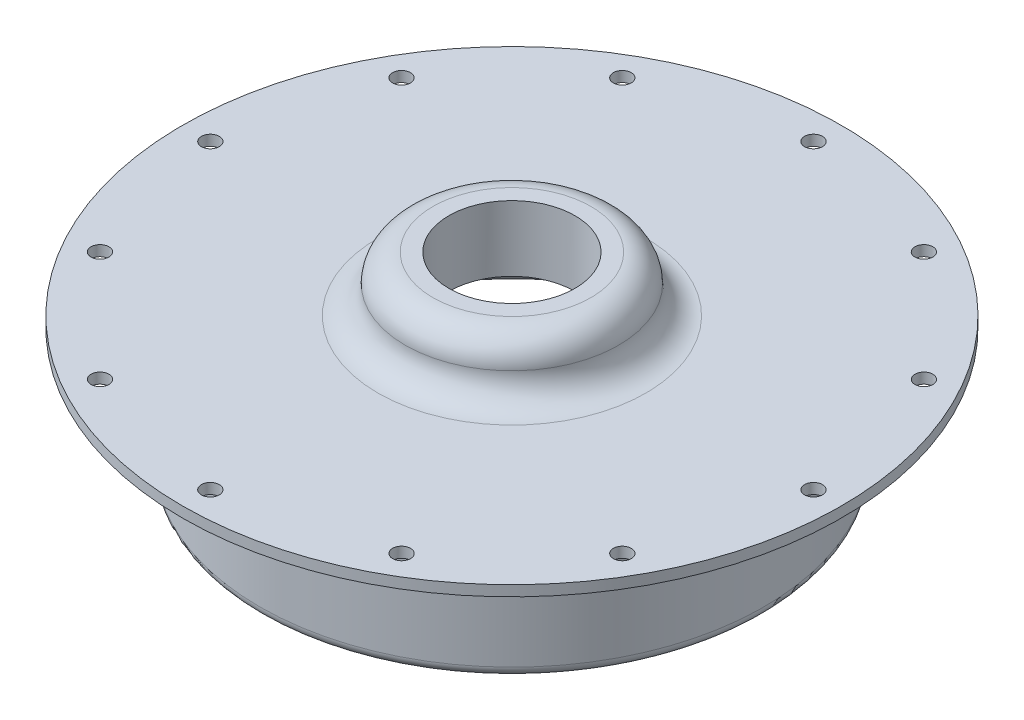
ISO-10303-21;
HEADER;
FILE_DESCRIPTION(('STEP AP214'),'2;1');
FILE_NAME('part.step','',(''),(''),'','','');
FILE_SCHEMA(('AUTOMOTIVE_DESIGN { 1 0 10303 214 1 1 1 1 }'));
ENDSEC;
DATA;
#1=APPLICATION_CONTEXT('core data for automotive mechanical design processes');
#2=APPLICATION_PROTOCOL_DEFINITION('international standard','automotive_design',2000,#1);
#3=PRODUCT_CONTEXT('',#1,'mechanical');
#4=PRODUCT('Part','Part','',(#3));
#5=PRODUCT_RELATED_PRODUCT_CATEGORY('part','',(#4));
#6=PRODUCT_DEFINITION_FORMATION('','',#4);
#7=PRODUCT_DEFINITION_CONTEXT('part definition',#1,'design');
#8=PRODUCT_DEFINITION('design','',#6,#7);
#9=PRODUCT_DEFINITION_SHAPE('','',#8);
#10=(LENGTH_UNIT() NAMED_UNIT(*) SI_UNIT(.MILLI.,.METRE.));
#11=(NAMED_UNIT(*) PLANE_ANGLE_UNIT() SI_UNIT($,.RADIAN.));
#12=(NAMED_UNIT(*) SI_UNIT($,.STERADIAN.) SOLID_ANGLE_UNIT());
#13=UNCERTAINTY_MEASURE_WITH_UNIT(LENGTH_MEASURE(1.E-05),#10,'distance_accuracy_value','');
#14=(GEOMETRIC_REPRESENTATION_CONTEXT(3) GLOBAL_UNCERTAINTY_ASSIGNED_CONTEXT((#13)) GLOBAL_UNIT_ASSIGNED_CONTEXT((#10,
#11,#12)) REPRESENTATION_CONTEXT('',''));
#15=CARTESIAN_POINT('',(0.,0.,0.));
#16=DIRECTION('',(0.,0.,1.));
#17=DIRECTION('',(1.,0.,0.));
#18=AXIS2_PLACEMENT_3D('',#15,#16,#17);
#19=CARTESIAN_POINT('',(0.,55.,0.));
#20=DIRECTION('',(0.,1.,0.));
#21=DIRECTION('',(0.,0.,1.));
#22=AXIS2_PLACEMENT_3D('',#19,#20,#21);
#23=CYLINDRICAL_SURFACE('',#22,49.784);
#24=CARTESIAN_POINT('',(0.,0.,0.));
#25=DIRECTION('',(0.,1.,0.));
#26=DIRECTION('',(0.,0.,1.));
#27=AXIS2_PLACEMENT_3D('',#24,#25,#26);
#28=CIRCLE('',#27,49.784);
#29=CARTESIAN_POINT('',(0.,0.,49.784));
#30=VERTEX_POINT('',#29);
#31=EDGE_CURVE('E10',#30,#30,#28,.T.);
#32=ORIENTED_EDGE('',*,*,#31,.T.);
#33=EDGE_LOOP('',(#32));
#34=FACE_BOUND('',#33,.T.);
#35=CARTESIAN_POINT('',(0.,1.5875,0.));
#36=DIRECTION('',(0.,1.,0.));
#37=DIRECTION('',(0.,0.,1.));
#38=AXIS2_PLACEMENT_3D('',#35,#36,#37);
#39=CIRCLE('',#38,49.784);
#40=CARTESIAN_POINT('',(0.,1.5875,49.784));
#41=VERTEX_POINT('',#40);
#42=EDGE_CURVE('E68',#41,#41,#39,.T.);
#43=ORIENTED_EDGE('',*,*,#42,.F.);
#44=EDGE_LOOP('',(#43));
#45=FACE_BOUND('',#44,.T.);
#46=ADVANCED_FACE('F31',(#34,#45),#23,.T.);
#47=CARTESIAN_POINT('',(-49.784,0.,0.));
#48=DIRECTION('',(0.,-1.,0.));
#49=DIRECTION('',(0.,0.,-1.));
#50=AXIS2_PLACEMENT_3D('',#47,#48,#49);
#51=PLANE('',#50);
#52=CARTESIAN_POINT('',(-39.4517006668589,0.,-22.7774500000015));
#53=DIRECTION('',(0.,-1.,0.));
#54=DIRECTION('',(0.,0.,-1.));
#55=AXIS2_PLACEMENT_3D('',#52,#53,#54);
#56=CIRCLE('',#55,1.35254999999999);
#57=CARTESIAN_POINT('',(-39.4517006668589,0.,-24.1300000000015));
#58=VERTEX_POINT('',#57);
#59=EDGE_CURVE('E134',#58,#58,#56,.T.);
#60=ORIENTED_EDGE('',*,*,#59,.F.);
#61=EDGE_LOOP('',(#60));
#62=FACE_BOUND('',#61,.T.);
#63=CARTESIAN_POINT('',(-22.7774499999985,0.,-39.4517006668606));
#64=DIRECTION('',(0.,-1.,0.));
#65=DIRECTION('',(0.,0.,-1.));
#66=AXIS2_PLACEMENT_3D('',#63,#64,#65);
#67=CIRCLE('',#66,1.35254999999999);
#68=CARTESIAN_POINT('',(-22.7774499999985,0.,-40.8042506668606));
#69=VERTEX_POINT('',#68);
#70=EDGE_CURVE('E128',#69,#69,#67,.T.);
#71=ORIENTED_EDGE('',*,*,#70,.F.);
#72=EDGE_LOOP('',(#71));
#73=FACE_BOUND('',#72,.T.);
#74=CARTESIAN_POINT('',(1.78252687187594E-12,0.,-45.5549));
#75=DIRECTION('',(0.,-1.,0.));
#76=DIRECTION('',(0.,0.,-1.));
#77=AXIS2_PLACEMENT_3D('',#74,#75,#76);
#78=CIRCLE('',#77,1.35254999999999);
#79=CARTESIAN_POINT('',(1.78252687187594E-12,0.,-46.90745));
#80=VERTEX_POINT('',#79);
#81=EDGE_CURVE('E122',#80,#80,#78,.T.);
#82=ORIENTED_EDGE('',*,*,#81,.F.);
#83=EDGE_LOOP('',(#82));
#84=FACE_BOUND('',#83,.T.);
#85=CARTESIAN_POINT('',(22.7774500000016,0.,-39.4517006668588));
#86=DIRECTION('',(0.,-1.,0.));
#87=DIRECTION('',(0.,0.,-1.));
#88=AXIS2_PLACEMENT_3D('',#85,#86,#87);
#89=CIRCLE('',#88,1.35254999999999);
#90=CARTESIAN_POINT('',(22.7774500000016,0.,-40.8042506668588));
#91=VERTEX_POINT('',#90);
#92=EDGE_CURVE('E116',#91,#91,#89,.T.);
#93=ORIENTED_EDGE('',*,*,#92,.F.);
#94=EDGE_LOOP('',(#93));
#95=FACE_BOUND('',#94,.T.);
#96=CARTESIAN_POINT('',(39.4517006668607,0.,-22.7774499999984));
#97=DIRECTION('',(0.,-1.,0.));
#98=DIRECTION('',(0.,0.,-1.));
#99=AXIS2_PLACEMENT_3D('',#96,#97,#98);
#100=CIRCLE('',#99,1.35254999999999);
#101=CARTESIAN_POINT('',(39.4517006668607,0.,-24.1299999999984));
#102=VERTEX_POINT('',#101);
#103=EDGE_CURVE('E34',#102,#102,#100,.T.);
#104=ORIENTED_EDGE('',*,*,#103,.F.);
#105=EDGE_LOOP('',(#104));
#106=FACE_BOUND('',#105,.T.);
#107=CARTESIAN_POINT('',(45.5549,0.,2.26523184822995E-12));
#108=DIRECTION('',(0.,-1.,0.));
#109=DIRECTION('',(0.,0.,-1.));
#110=AXIS2_PLACEMENT_3D('',#107,#108,#109);
#111=CIRCLE('',#110,1.35254999999999);
#112=CARTESIAN_POINT('',(45.5549,0.,-1.35254999999773));
#113=VERTEX_POINT('',#112);
#114=EDGE_CURVE('E107',#113,#113,#111,.T.);
#115=ORIENTED_EDGE('',*,*,#114,.F.);
#116=EDGE_LOOP('',(#115));
#117=FACE_BOUND('',#116,.T.);
#118=CARTESIAN_POINT('',(39.4517006668587,0.,22.7774500000017));
#119=DIRECTION('',(0.,-1.,0.));
#120=DIRECTION('',(0.,0.,-1.));
#121=AXIS2_PLACEMENT_3D('',#118,#119,#120);
#122=CIRCLE('',#121,1.35254999999999);
#123=CARTESIAN_POINT('',(39.4517006668587,0.,21.4249000000017));
#124=VERTEX_POINT('',#123);
#125=EDGE_CURVE('E101',#124,#124,#122,.T.);
#126=ORIENTED_EDGE('',*,*,#125,.F.);
#127=EDGE_LOOP('',(#126));
#128=FACE_BOUND('',#127,.T.);
#129=CARTESIAN_POINT('',(22.7774499999982,0.,39.4517006668608));
#130=DIRECTION('',(0.,-1.,0.));
#131=DIRECTION('',(0.,0.,-1.));
#132=AXIS2_PLACEMENT_3D('',#129,#130,#131);
#133=CIRCLE('',#132,1.35254999999999);
#134=CARTESIAN_POINT('',(22.7774499999982,0.,38.0991506668608));
#135=VERTEX_POINT('',#134);
#136=EDGE_CURVE('E95',#135,#135,#133,.T.);
#137=ORIENTED_EDGE('',*,*,#136,.F.);
#138=EDGE_LOOP('',(#137));
#139=FACE_BOUND('',#138,.T.);
#140=CARTESIAN_POINT('',(-2.1117204916125E-12,0.,45.5549));
#141=DIRECTION('',(0.,-1.,0.));
#142=DIRECTION('',(0.,0.,-1.));
#143=AXIS2_PLACEMENT_3D('',#140,#141,#142);
#144=CIRCLE('',#143,1.35254999999999);
#145=CARTESIAN_POINT('',(-2.1117204916125E-12,0.,44.20235));
#146=VERTEX_POINT('',#145);
#147=EDGE_CURVE('E89',#146,#146,#144,.T.);
#148=ORIENTED_EDGE('',*,*,#147,.F.);
#149=EDGE_LOOP('',(#148));
#150=FACE_BOUND('',#149,.T.);
#151=CARTESIAN_POINT('',(-22.7774500000019,0.,39.4517006668587));
#152=DIRECTION('',(0.,-1.,0.));
#153=DIRECTION('',(0.,0.,-1.));
#154=AXIS2_PLACEMENT_3D('',#151,#152,#153);
#155=CIRCLE('',#154,1.35254999999999);
#156=CARTESIAN_POINT('',(-22.7774500000019,0.,38.0991506668587));
#157=VERTEX_POINT('',#156);
#158=EDGE_CURVE('E83',#157,#157,#155,.T.);
#159=ORIENTED_EDGE('',*,*,#158,.F.);
#160=EDGE_LOOP('',(#159));
#161=FACE_BOUND('',#160,.T.);
#162=CARTESIAN_POINT('',(-39.4517006668608,0.,22.7774499999981));
#163=DIRECTION('',(0.,-1.,0.));
#164=DIRECTION('',(0.,0.,-1.));
#165=AXIS2_PLACEMENT_3D('',#162,#163,#164);
#166=CIRCLE('',#165,1.35254999999999);
#167=CARTESIAN_POINT('',(-39.4517006668608,0.,21.4248999999981));
#168=VERTEX_POINT('',#167);
#169=EDGE_CURVE('E77',#168,#168,#166,.T.);
#170=ORIENTED_EDGE('',*,*,#169,.F.);
#171=EDGE_LOOP('',(#170));
#172=FACE_BOUND('',#171,.T.);
#173=CARTESIAN_POINT('',(-45.5549,0.,-2.26523184822995E-12));
#174=DIRECTION('',(0.,-1.,0.));
#175=DIRECTION('',(0.,0.,-1.));
#176=AXIS2_PLACEMENT_3D('',#173,#174,#175);
#177=CIRCLE('',#176,1.35254999999999);
#178=CARTESIAN_POINT('',(-45.5549,0.,-1.35255000000226));
#179=VERTEX_POINT('',#178);
#180=EDGE_CURVE('E71',#179,#179,#177,.T.);
#181=ORIENTED_EDGE('',*,*,#180,.F.);
#182=EDGE_LOOP('',(#181));
#183=FACE_BOUND('',#182,.T.);
#184=CARTESIAN_POINT('',(0.,0.,0.));
#185=DIRECTION('',(0.,1.,0.));
#186=DIRECTION('',(0.,0.,1.));
#187=AXIS2_PLACEMENT_3D('',#184,#185,#186);
#188=CIRCLE('',#187,39.6874999999754);
#189=CARTESIAN_POINT('',(0.,0.,39.6874999999754));
#190=VERTEX_POINT('',#189);
#191=EDGE_CURVE('E38',#190,#190,#188,.T.);
#192=ORIENTED_EDGE('',*,*,#191,.T.);
#193=EDGE_LOOP('',(#192));
#194=FACE_BOUND('',#193,.T.);
#195=ORIENTED_EDGE('',*,*,#31,.F.);
#196=EDGE_LOOP('',(#195));
#197=FACE_BOUND('',#196,.T.);
#198=ADVANCED_FACE('F168',(#62,#73,#84,#95,#106,#117,#128,#139,#150,#161,#172,#183,#194,#197),
#51,.T.);
#199=CARTESIAN_POINT('',(0.,-1.5875,0.));
#200=DIRECTION('',(0.,1.,0.));
#201=DIRECTION('',(0.,0.,1.));
#202=AXIS2_PLACEMENT_3D('',#199,#200,#201);
#203=TOROIDAL_SURFACE('',#202,39.6874999999754,1.5875);
#204=CARTESIAN_POINT('',(0.,-1.5875,0.));
#205=DIRECTION('',(0.,1.,0.));
#206=DIRECTION('',(0.,0.,1.));
#207=AXIS2_PLACEMENT_3D('',#204,#205,#206);
#208=CIRCLE('',#207,38.0999999999754);
#209=CARTESIAN_POINT('',(0.,-1.5875,38.0999999999754));
#210=VERTEX_POINT('',#209);
#211=EDGE_CURVE('E42',#210,#210,#208,.T.);
#212=ORIENTED_EDGE('',*,*,#211,.T.);
#213=EDGE_LOOP('',(#212));
#214=FACE_BOUND('',#213,.T.);
#215=ORIENTED_EDGE('',*,*,#191,.F.);
#216=EDGE_LOOP('',(#215));
#217=FACE_BOUND('',#216,.T.);
#218=ADVANCED_FACE('F172',(#214,#217),#203,.F.);
#219=CARTESIAN_POINT('',(0.,55.,0.));
#220=DIRECTION('',(0.,1.,0.));
#221=DIRECTION('',(0.,0.,1.));
#222=AXIS2_PLACEMENT_3D('',#219,#220,#221);
#223=CYLINDRICAL_SURFACE('',#222,38.0999999999754);
#224=CARTESIAN_POINT('',(0.,-17.4625,0.));
#225=DIRECTION('',(0.,1.,0.));
#226=DIRECTION('',(0.,0.,1.));
#227=AXIS2_PLACEMENT_3D('',#224,#225,#226);
#228=CIRCLE('',#227,38.0999999999754);
#229=CARTESIAN_POINT('',(0.,-17.4625,38.0999999999754));
#230=VERTEX_POINT('',#229);
#231=EDGE_CURVE('E47',#230,#230,#228,.T.);
#232=ORIENTED_EDGE('',*,*,#231,.T.);
#233=EDGE_LOOP('',(#232));
#234=FACE_BOUND('',#233,.T.);
#235=ORIENTED_EDGE('',*,*,#211,.F.);
#236=EDGE_LOOP('',(#235));
#237=FACE_BOUND('',#236,.T.);
#238=ADVANCED_FACE('F263',(#234,#237),#223,.T.);
#239=CARTESIAN_POINT('',(0.,-17.4625,0.));
#240=DIRECTION('',(0.,1.,0.));
#241=DIRECTION('',(0.,0.,1.));
#242=AXIS2_PLACEMENT_3D('',#239,#240,#241);
#243=TOROIDAL_SURFACE('',#242,36.5124999999754,1.5875);
#244=CARTESIAN_POINT('',(0.,-17.4625,0.));
#245=DIRECTION('',(0.,1.,0.));
#246=DIRECTION('',(0.,0.,1.));
#247=AXIS2_PLACEMENT_3D('',#244,#245,#246);
#248=CIRCLE('',#247,34.9249999999754);
#249=CARTESIAN_POINT('',(0.,-17.4625,34.9249999999754));
#250=VERTEX_POINT('',#249);
#251=EDGE_CURVE('E50',#250,#250,#248,.T.);
#252=ORIENTED_EDGE('',*,*,#251,.T.);
#253=EDGE_LOOP('',(#252));
#254=FACE_BOUND('',#253,.T.);
#255=ORIENTED_EDGE('',*,*,#231,.F.);
#256=EDGE_LOOP('',(#255));
#257=FACE_BOUND('',#256,.T.);
#258=ADVANCED_FACE('F257',(#254,#257),#243,.T.);
#259=CARTESIAN_POINT('',(0.,55.,0.));
#260=DIRECTION('',(0.,1.,0.));
#261=DIRECTION('',(0.,0.,1.));
#262=AXIS2_PLACEMENT_3D('',#259,#260,#261);
#263=CYLINDRICAL_SURFACE('',#262,34.9249999999754);
#264=CARTESIAN_POINT('',(0.,-3.175,0.));
#265=DIRECTION('',(0.,1.,0.));
#266=DIRECTION('',(0.,0.,1.));
#267=AXIS2_PLACEMENT_3D('',#264,#265,#266);
#268=CIRCLE('',#267,34.9249999999754);
#269=CARTESIAN_POINT('',(0.,-3.175,34.9249999999754));
#270=VERTEX_POINT('',#269);
#271=EDGE_CURVE('E53',#270,#270,#268,.T.);
#272=ORIENTED_EDGE('',*,*,#271,.T.);
#273=EDGE_LOOP('',(#272));
#274=FACE_BOUND('',#273,.T.);
#275=ORIENTED_EDGE('',*,*,#251,.F.);
#276=EDGE_LOOP('',(#275));
#277=FACE_BOUND('',#276,.T.);
#278=ADVANCED_FACE('F251',(#274,#277),#263,.F.);
#279=CARTESIAN_POINT('',(0.,-3.175,0.));
#280=DIRECTION('',(0.,1.,0.));
#281=DIRECTION('',(0.,0.,1.));
#282=AXIS2_PLACEMENT_3D('',#279,#280,#281);
#283=TOROIDAL_SURFACE('',#282,31.7499999999754,3.17499999999999);
#284=CARTESIAN_POINT('',(0.,0.,0.));
#285=DIRECTION('',(0.,1.,0.));
#286=DIRECTION('',(0.,0.,1.));
#287=AXIS2_PLACEMENT_3D('',#284,#285,#286);
#288=CIRCLE('',#287,31.7499999999754);
#289=CARTESIAN_POINT('',(0.,0.,31.7499999999754));
#290=VERTEX_POINT('',#289);
#291=EDGE_CURVE('E56',#290,#290,#288,.T.);
#292=ORIENTED_EDGE('',*,*,#291,.T.);
#293=EDGE_LOOP('',(#292));
#294=FACE_BOUND('',#293,.T.);
#295=ORIENTED_EDGE('',*,*,#271,.F.);
#296=EDGE_LOOP('',(#295));
#297=FACE_BOUND('',#296,.T.);
#298=ADVANCED_FACE('F245',(#294,#297),#283,.F.);
#299=CARTESIAN_POINT('',(-31.7499999999754,0.,0.));
#300=DIRECTION('',(0.,-1.,0.));
#301=DIRECTION('',(0.,0.,-1.));
#302=AXIS2_PLACEMENT_3D('',#299,#300,#301);
#303=PLANE('',#302);
#304=CARTESIAN_POINT('',(0.,0.,0.));
#305=DIRECTION('',(0.,-1.,0.));
#306=DIRECTION('',(0.,0.,-1.));
#307=AXIS2_PLACEMENT_3D('',#304,#305,#306);
#308=CIRCLE('',#307,9.52499999999998);
#309=CARTESIAN_POINT('',(0.,0.,-9.52499999999998));
#310=VERTEX_POINT('',#309);
#311=EDGE_CURVE('E140',#310,#310,#308,.T.);
#312=ORIENTED_EDGE('',*,*,#311,.F.);
#313=EDGE_LOOP('',(#312));
#314=FACE_BOUND('',#313,.T.);
#315=ORIENTED_EDGE('',*,*,#291,.F.);
#316=EDGE_LOOP('',(#315));
#317=FACE_BOUND('',#316,.T.);
#318=ADVANCED_FACE('F153',(#314,#317),#303,.T.);
#319=CARTESIAN_POINT('',(-5.588,9.906,0.));
#320=DIRECTION('',(0.,1.,0.));
#321=DIRECTION('',(0.,0.,1.));
#322=AXIS2_PLACEMENT_3D('',#319,#320,#321);
#323=PLANE('',#322);
#324=CARTESIAN_POINT('',(0.,9.906,0.));
#325=DIRECTION('',(0.,1.,0.));
#326=DIRECTION('',(0.,0.,1.));
#327=AXIS2_PLACEMENT_3D('',#324,#325,#326);
#328=CIRCLE('',#327,9.52499999999999);
#329=CARTESIAN_POINT('',(0.,9.906,9.52499999999999));
#330=VERTEX_POINT('',#329);
#331=EDGE_CURVE('E143',#330,#330,#328,.T.);
#332=ORIENTED_EDGE('',*,*,#331,.F.);
#333=EDGE_LOOP('',(#332));
#334=FACE_BOUND('',#333,.T.);
#335=CARTESIAN_POINT('',(0.,9.906,0.));
#336=DIRECTION('',(0.,1.,0.));
#337=DIRECTION('',(0.,0.,1.));
#338=AXIS2_PLACEMENT_3D('',#335,#336,#337);
#339=CIRCLE('',#338,11.938);
#340=CARTESIAN_POINT('',(0.,9.906,11.938));
#341=VERTEX_POINT('',#340);
#342=EDGE_CURVE('E59',#341,#341,#339,.T.);
#343=ORIENTED_EDGE('',*,*,#342,.T.);
#344=EDGE_LOOP('',(#343));
#345=FACE_BOUND('',#344,.T.);
#346=ADVANCED_FACE('F149',(#334,#345),#323,.T.);
#347=CARTESIAN_POINT('',(0.,5.74675,0.));
#348=DIRECTION('',(0.,1.,0.));
#349=DIRECTION('',(0.,0.,1.));
#350=AXIS2_PLACEMENT_3D('',#347,#348,#349);
#351=TOROIDAL_SURFACE('',#350,11.938,4.15925);
#352=CARTESIAN_POINT('',(0.,5.74675,0.));
#353=DIRECTION('',(0.,1.,0.));
#354=DIRECTION('',(0.,0.,1.));
#355=AXIS2_PLACEMENT_3D('',#352,#353,#354);
#356=CIRCLE('',#355,16.09725);
#357=CARTESIAN_POINT('',(0.,5.74675,16.09725));
#358=VERTEX_POINT('',#357);
#359=EDGE_CURVE('E62',#358,#358,#356,.T.);
#360=ORIENTED_EDGE('',*,*,#359,.T.);
#361=EDGE_LOOP('',(#360));
#362=FACE_BOUND('',#361,.T.);
#363=ORIENTED_EDGE('',*,*,#342,.F.);
#364=EDGE_LOOP('',(#363));
#365=FACE_BOUND('',#364,.T.);
#366=ADVANCED_FACE('F152',(#362,#365),#351,.T.);
#367=CARTESIAN_POINT('',(0.,5.74675,0.));
#368=DIRECTION('',(0.,1.,0.));
#369=DIRECTION('',(0.,0.,1.));
#370=AXIS2_PLACEMENT_3D('',#367,#368,#369);
#371=TOROIDAL_SURFACE('',#370,20.2565,4.15925);
#372=CARTESIAN_POINT('',(0.,1.5875,0.));
#373=DIRECTION('',(0.,1.,0.));
#374=DIRECTION('',(0.,0.,1.));
#375=AXIS2_PLACEMENT_3D('',#372,#373,#374);
#376=CIRCLE('',#375,20.2565);
#377=CARTESIAN_POINT('',(0.,1.5875,20.2565));
#378=VERTEX_POINT('',#377);
#379=EDGE_CURVE('E65',#378,#378,#376,.T.);
#380=ORIENTED_EDGE('',*,*,#379,.T.);
#381=EDGE_LOOP('',(#380));
#382=FACE_BOUND('',#381,.T.);
#383=ORIENTED_EDGE('',*,*,#359,.F.);
#384=EDGE_LOOP('',(#383));
#385=FACE_BOUND('',#384,.T.);
#386=ADVANCED_FACE('F158',(#382,#385),#371,.F.);
#387=CARTESIAN_POINT('',(-49.784,1.5875,0.));
#388=DIRECTION('',(0.,1.,0.));
#389=DIRECTION('',(0.,0.,1.));
#390=AXIS2_PLACEMENT_3D('',#387,#388,#389);
#391=PLANE('',#390);
#392=CARTESIAN_POINT('',(-39.4517006668589,1.58750000000002,-22.7774500000015));
#393=DIRECTION('',(0.,1.,0.));
#394=DIRECTION('',(0.,0.,1.));
#395=AXIS2_PLACEMENT_3D('',#392,#393,#394);
#396=CIRCLE('',#395,1.35254999999999);
#397=CARTESIAN_POINT('',(-39.4517006668589,1.58750000000002,-21.4249000000015));
#398=VERTEX_POINT('',#397);
#399=EDGE_CURVE('E137',#398,#398,#396,.T.);
#400=ORIENTED_EDGE('',*,*,#399,.F.);
#401=EDGE_LOOP('',(#400));
#402=FACE_BOUND('',#401,.T.);
#403=CARTESIAN_POINT('',(-22.7774499999985,1.58750000000008,-39.4517006668606));
#404=DIRECTION('',(0.,1.,0.));
#405=DIRECTION('',(0.,0.,1.));
#406=AXIS2_PLACEMENT_3D('',#403,#404,#405);
#407=CIRCLE('',#406,1.35254999999999);
#408=CARTESIAN_POINT('',(-22.7774499999985,1.58750000000008,-38.0991506668606));
#409=VERTEX_POINT('',#408);
#410=EDGE_CURVE('E131',#409,#409,#407,.T.);
#411=ORIENTED_EDGE('',*,*,#410,.F.);
#412=EDGE_LOOP('',(#411));
#413=FACE_BOUND('',#412,.T.);
#414=CARTESIAN_POINT('',(1.78252687187594E-12,1.58750000000016,-45.5549));
#415=DIRECTION('',(0.,1.,0.));
#416=DIRECTION('',(0.,0.,1.));
#417=AXIS2_PLACEMENT_3D('',#414,#415,#416);
#418=CIRCLE('',#417,1.35254999999999);
#419=CARTESIAN_POINT('',(1.78252687187594E-12,1.58750000000015,-44.20235));
#420=VERTEX_POINT('',#419);
#421=EDGE_CURVE('E125',#420,#420,#418,.T.);
#422=ORIENTED_EDGE('',*,*,#421,.F.);
#423=EDGE_LOOP('',(#422));
#424=FACE_BOUND('',#423,.T.);
#425=CARTESIAN_POINT('',(22.7774500000016,1.58750000000024,-39.4517006668588));
#426=DIRECTION('',(0.,1.,0.));
#427=DIRECTION('',(0.,0.,1.));
#428=AXIS2_PLACEMENT_3D('',#425,#426,#427);
#429=CIRCLE('',#428,1.35254999999999);
#430=CARTESIAN_POINT('',(22.7774500000016,1.58750000000024,-38.0991506668588));
#431=VERTEX_POINT('',#430);
#432=EDGE_CURVE('E119',#431,#431,#429,.T.);
#433=ORIENTED_EDGE('',*,*,#432,.F.);
#434=EDGE_LOOP('',(#433));
#435=FACE_BOUND('',#434,.T.);
#436=CARTESIAN_POINT('',(39.4517006668607,1.5875000000003,-22.7774499999984));
#437=DIRECTION('',(0.,1.,0.));
#438=DIRECTION('',(0.,0.,1.));
#439=AXIS2_PLACEMENT_3D('',#436,#437,#438);
#440=CIRCLE('',#439,1.35254999999999);
#441=CARTESIAN_POINT('',(39.4517006668607,1.5875000000003,-21.4248999999984));
#442=VERTEX_POINT('',#441);
#443=EDGE_CURVE('E113',#442,#442,#440,.T.);
#444=ORIENTED_EDGE('',*,*,#443,.F.);
#445=EDGE_LOOP('',(#444));
#446=FACE_BOUND('',#445,.T.);
#447=CARTESIAN_POINT('',(45.5549,1.58750000000032,2.26523184822995E-12));
#448=DIRECTION('',(0.,1.,0.));
#449=DIRECTION('',(0.,0.,1.));
#450=AXIS2_PLACEMENT_3D('',#447,#448,#449);
#451=CIRCLE('',#450,1.35254999999999);
#452=CARTESIAN_POINT('',(45.5549,1.58750000000032,1.35255000000225));
#453=VERTEX_POINT('',#452);
#454=EDGE_CURVE('E110',#453,#453,#451,.T.);
#455=ORIENTED_EDGE('',*,*,#454,.F.);
#456=EDGE_LOOP('',(#455));
#457=FACE_BOUND('',#456,.T.);
#458=CARTESIAN_POINT('',(39.4517006668587,1.5875000000003,22.7774500000017));
#459=DIRECTION('',(0.,1.,0.));
#460=DIRECTION('',(0.,0.,1.));
#461=AXIS2_PLACEMENT_3D('',#458,#459,#460);
#462=CIRCLE('',#461,1.35254999999999);
#463=CARTESIAN_POINT('',(39.4517006668587,1.5875000000003,24.1300000000017));
#464=VERTEX_POINT('',#463);
#465=EDGE_CURVE('E104',#464,#464,#462,.T.);
#466=ORIENTED_EDGE('',*,*,#465,.F.);
#467=EDGE_LOOP('',(#466));
#468=FACE_BOUND('',#467,.T.);
#469=CARTESIAN_POINT('',(22.7774499999982,1.58750000000024,39.4517006668608));
#470=DIRECTION('',(0.,1.,0.));
#471=DIRECTION('',(0.,0.,1.));
#472=AXIS2_PLACEMENT_3D('',#469,#470,#471);
#473=CIRCLE('',#472,1.35254999999999);
#474=CARTESIAN_POINT('',(22.7774499999982,1.58750000000024,40.8042506668608));
#475=VERTEX_POINT('',#474);
#476=EDGE_CURVE('E98',#475,#475,#473,.T.);
#477=ORIENTED_EDGE('',*,*,#476,.F.);
#478=EDGE_LOOP('',(#477));
#479=FACE_BOUND('',#478,.T.);
#480=CARTESIAN_POINT('',(-2.1117204916125E-12,1.58750000000016,45.5549));
#481=DIRECTION('',(0.,1.,0.));
#482=DIRECTION('',(0.,0.,1.));
#483=AXIS2_PLACEMENT_3D('',#480,#481,#482);
#484=CIRCLE('',#483,1.35254999999999);
#485=CARTESIAN_POINT('',(-2.1117204916125E-12,1.58750000000016,46.90745));
#486=VERTEX_POINT('',#485);
#487=EDGE_CURVE('E92',#486,#486,#484,.T.);
#488=ORIENTED_EDGE('',*,*,#487,.F.);
#489=EDGE_LOOP('',(#488));
#490=FACE_BOUND('',#489,.T.);
#491=CARTESIAN_POINT('',(-22.7774500000019,1.58750000000008,39.4517006668586));
#492=DIRECTION('',(0.,1.,0.));
#493=DIRECTION('',(0.,0.,1.));
#494=AXIS2_PLACEMENT_3D('',#491,#492,#493);
#495=CIRCLE('',#494,1.35254999999999);
#496=CARTESIAN_POINT('',(-22.7774500000019,1.58750000000008,40.8042506668586));
#497=VERTEX_POINT('',#496);
#498=EDGE_CURVE('E86',#497,#497,#495,.T.);
#499=ORIENTED_EDGE('',*,*,#498,.F.);
#500=EDGE_LOOP('',(#499));
#501=FACE_BOUND('',#500,.T.);
#502=CARTESIAN_POINT('',(-39.4517006668608,1.58750000000002,22.7774499999981));
#503=DIRECTION('',(0.,1.,0.));
#504=DIRECTION('',(0.,0.,1.));
#505=AXIS2_PLACEMENT_3D('',#502,#503,#504);
#506=CIRCLE('',#505,1.35254999999999);
#507=CARTESIAN_POINT('',(-39.4517006668608,1.58750000000002,24.1299999999981));
#508=VERTEX_POINT('',#507);
#509=EDGE_CURVE('E80',#508,#508,#506,.T.);
#510=ORIENTED_EDGE('',*,*,#509,.F.);
#511=EDGE_LOOP('',(#510));
#512=FACE_BOUND('',#511,.T.);
#513=CARTESIAN_POINT('',(-45.5549,1.5875,-2.26523184822995E-12));
#514=DIRECTION('',(0.,1.,0.));
#515=DIRECTION('',(0.,0.,1.));
#516=AXIS2_PLACEMENT_3D('',#513,#514,#515);
#517=CIRCLE('',#516,1.35254999999999);
#518=CARTESIAN_POINT('',(-45.5549,1.5875,1.35254999999772));
#519=VERTEX_POINT('',#518);
#520=EDGE_CURVE('E74',#519,#519,#517,.T.);
#521=ORIENTED_EDGE('',*,*,#520,.F.);
#522=EDGE_LOOP('',(#521));
#523=FACE_BOUND('',#522,.T.);
#524=ORIENTED_EDGE('',*,*,#42,.T.);
#525=EDGE_LOOP('',(#524));
#526=FACE_BOUND('',#525,.T.);
#527=ORIENTED_EDGE('',*,*,#379,.F.);
#528=EDGE_LOOP('',(#527));
#529=FACE_BOUND('',#528,.T.);
#530=ADVANCED_FACE('F164',(#402,#413,#424,#435,#446,#457,#468,#479,#490,#501,#512,#523,#526,
#529),#391,.T.);
#531=CARTESIAN_POINT('',(-45.5549,1.5875,-2.26523184822995E-12));
#532=DIRECTION('',(0.,1.,0.));
#533=DIRECTION('',(0.,0.,1.));
#534=AXIS2_PLACEMENT_3D('',#531,#532,#533);
#535=CYLINDRICAL_SURFACE('',#534,1.35254999999999);
#536=ORIENTED_EDGE('',*,*,#180,.T.);
#537=EDGE_LOOP('',(#536));
#538=FACE_BOUND('',#537,.T.);
#539=ORIENTED_EDGE('',*,*,#520,.T.);
#540=EDGE_LOOP('',(#539));
#541=FACE_BOUND('',#540,.T.);
#542=ADVANCED_FACE('F179',(#538,#541),#535,.F.);
#543=CARTESIAN_POINT('',(-39.4517006668608,1.58750000000002,22.7774499999981));
#544=DIRECTION('',(0.,1.,0.));
#545=DIRECTION('',(0.,0.,1.));
#546=AXIS2_PLACEMENT_3D('',#543,#544,#545);
#547=CYLINDRICAL_SURFACE('',#546,1.35254999999999);
#548=ORIENTED_EDGE('',*,*,#169,.T.);
#549=EDGE_LOOP('',(#548));
#550=FACE_BOUND('',#549,.T.);
#551=ORIENTED_EDGE('',*,*,#509,.T.);
#552=EDGE_LOOP('',(#551));
#553=FACE_BOUND('',#552,.T.);
#554=ADVANCED_FACE('F188',(#550,#553),#547,.F.);
#555=CARTESIAN_POINT('',(-22.7774500000019,1.58750000000008,39.4517006668586));
#556=DIRECTION('',(0.,1.,0.));
#557=DIRECTION('',(0.,0.,1.));
#558=AXIS2_PLACEMENT_3D('',#555,#556,#557);
#559=CYLINDRICAL_SURFACE('',#558,1.35254999999999);
#560=ORIENTED_EDGE('',*,*,#158,.T.);
#561=EDGE_LOOP('',(#560));
#562=FACE_BOUND('',#561,.T.);
#563=ORIENTED_EDGE('',*,*,#498,.T.);
#564=EDGE_LOOP('',(#563));
#565=FACE_BOUND('',#564,.T.);
#566=ADVANCED_FACE('F196',(#562,#565),#559,.F.);
#567=CARTESIAN_POINT('',(-2.1117204916125E-12,1.58750000000016,45.5549));
#568=DIRECTION('',(0.,1.,0.));
#569=DIRECTION('',(0.,0.,1.));
#570=AXIS2_PLACEMENT_3D('',#567,#568,#569);
#571=CYLINDRICAL_SURFACE('',#570,1.35254999999999);
#572=ORIENTED_EDGE('',*,*,#147,.T.);
#573=EDGE_LOOP('',(#572));
#574=FACE_BOUND('',#573,.T.);
#575=ORIENTED_EDGE('',*,*,#487,.T.);
#576=EDGE_LOOP('',(#575));
#577=FACE_BOUND('',#576,.T.);
#578=ADVANCED_FACE('F200',(#574,#577),#571,.F.);
#579=CARTESIAN_POINT('',(22.7774499999982,1.58750000000024,39.4517006668608));
#580=DIRECTION('',(0.,1.,0.));
#581=DIRECTION('',(0.,0.,1.));
#582=AXIS2_PLACEMENT_3D('',#579,#580,#581);
#583=CYLINDRICAL_SURFACE('',#582,1.35254999999999);
#584=ORIENTED_EDGE('',*,*,#136,.T.);
#585=EDGE_LOOP('',(#584));
#586=FACE_BOUND('',#585,.T.);
#587=ORIENTED_EDGE('',*,*,#476,.T.);
#588=EDGE_LOOP('',(#587));
#589=FACE_BOUND('',#588,.T.);
#590=ADVANCED_FACE('F204',(#586,#589),#583,.F.);
#591=CARTESIAN_POINT('',(39.4517006668587,1.5875000000003,22.7774500000017));
#592=DIRECTION('',(0.,1.,0.));
#593=DIRECTION('',(0.,0.,1.));
#594=AXIS2_PLACEMENT_3D('',#591,#592,#593);
#595=CYLINDRICAL_SURFACE('',#594,1.35254999999999);
#596=ORIENTED_EDGE('',*,*,#125,.T.);
#597=EDGE_LOOP('',(#596));
#598=FACE_BOUND('',#597,.T.);
#599=ORIENTED_EDGE('',*,*,#465,.T.);
#600=EDGE_LOOP('',(#599));
#601=FACE_BOUND('',#600,.T.);
#602=ADVANCED_FACE('F208',(#598,#601),#595,.F.);
#603=CARTESIAN_POINT('',(45.5549,1.58750000000032,2.26523184822995E-12));
#604=DIRECTION('',(0.,1.,0.));
#605=DIRECTION('',(0.,0.,1.));
#606=AXIS2_PLACEMENT_3D('',#603,#604,#605);
#607=CYLINDRICAL_SURFACE('',#606,1.35254999999999);
#608=ORIENTED_EDGE('',*,*,#114,.T.);
#609=EDGE_LOOP('',(#608));
#610=FACE_BOUND('',#609,.T.);
#611=ORIENTED_EDGE('',*,*,#454,.T.);
#612=EDGE_LOOP('',(#611));
#613=FACE_BOUND('',#612,.T.);
#614=ADVANCED_FACE('F212',(#610,#613),#607,.F.);
#615=CARTESIAN_POINT('',(39.4517006668607,1.5875000000003,-22.7774499999984));
#616=DIRECTION('',(0.,1.,0.));
#617=DIRECTION('',(0.,0.,1.));
#618=AXIS2_PLACEMENT_3D('',#615,#616,#617);
#619=CYLINDRICAL_SURFACE('',#618,1.35254999999999);
#620=ORIENTED_EDGE('',*,*,#103,.T.);
#621=EDGE_LOOP('',(#620));
#622=FACE_BOUND('',#621,.T.);
#623=ORIENTED_EDGE('',*,*,#443,.T.);
#624=EDGE_LOOP('',(#623));
#625=FACE_BOUND('',#624,.T.);
#626=ADVANCED_FACE('F216',(#622,#625),#619,.F.);
#627=CARTESIAN_POINT('',(22.7774500000016,1.58750000000024,-39.4517006668588));
#628=DIRECTION('',(0.,1.,0.));
#629=DIRECTION('',(0.,0.,1.));
#630=AXIS2_PLACEMENT_3D('',#627,#628,#629);
#631=CYLINDRICAL_SURFACE('',#630,1.35254999999999);
#632=ORIENTED_EDGE('',*,*,#92,.T.);
#633=EDGE_LOOP('',(#632));
#634=FACE_BOUND('',#633,.T.);
#635=ORIENTED_EDGE('',*,*,#432,.T.);
#636=EDGE_LOOP('',(#635));
#637=FACE_BOUND('',#636,.T.);
#638=ADVANCED_FACE('F220',(#634,#637),#631,.F.);
#639=CARTESIAN_POINT('',(1.78252687187594E-12,1.58750000000016,-45.5549));
#640=DIRECTION('',(0.,1.,0.));
#641=DIRECTION('',(0.,0.,1.));
#642=AXIS2_PLACEMENT_3D('',#639,#640,#641);
#643=CYLINDRICAL_SURFACE('',#642,1.35254999999999);
#644=ORIENTED_EDGE('',*,*,#81,.T.);
#645=EDGE_LOOP('',(#644));
#646=FACE_BOUND('',#645,.T.);
#647=ORIENTED_EDGE('',*,*,#421,.T.);
#648=EDGE_LOOP('',(#647));
#649=FACE_BOUND('',#648,.T.);
#650=ADVANCED_FACE('F224',(#646,#649),#643,.F.);
#651=CARTESIAN_POINT('',(-22.7774499999985,1.58750000000008,-39.4517006668606));
#652=DIRECTION('',(0.,1.,0.));
#653=DIRECTION('',(0.,0.,1.));
#654=AXIS2_PLACEMENT_3D('',#651,#652,#653);
#655=CYLINDRICAL_SURFACE('',#654,1.35254999999999);
#656=ORIENTED_EDGE('',*,*,#70,.T.);
#657=EDGE_LOOP('',(#656));
#658=FACE_BOUND('',#657,.T.);
#659=ORIENTED_EDGE('',*,*,#410,.T.);
#660=EDGE_LOOP('',(#659));
#661=FACE_BOUND('',#660,.T.);
#662=ADVANCED_FACE('F228',(#658,#661),#655,.F.);
#663=CARTESIAN_POINT('',(-39.4517006668589,1.58750000000002,-22.7774500000015));
#664=DIRECTION('',(0.,1.,0.));
#665=DIRECTION('',(0.,0.,1.));
#666=AXIS2_PLACEMENT_3D('',#663,#664,#665);
#667=CYLINDRICAL_SURFACE('',#666,1.35254999999999);
#668=ORIENTED_EDGE('',*,*,#59,.T.);
#669=EDGE_LOOP('',(#668));
#670=FACE_BOUND('',#669,.T.);
#671=ORIENTED_EDGE('',*,*,#399,.T.);
#672=EDGE_LOOP('',(#671));
#673=FACE_BOUND('',#672,.T.);
#674=ADVANCED_FACE('F232',(#670,#673),#667,.F.);
#675=CARTESIAN_POINT('',(0.,9.906,0.));
#676=DIRECTION('',(0.,1.,0.));
#677=DIRECTION('',(0.,0.,1.));
#678=AXIS2_PLACEMENT_3D('',#675,#676,#677);
#679=CYLINDRICAL_SURFACE('',#678,9.52499999999998);
#680=ORIENTED_EDGE('',*,*,#311,.T.);
#681=EDGE_LOOP('',(#680));
#682=FACE_BOUND('',#681,.T.);
#683=ORIENTED_EDGE('',*,*,#331,.T.);
#684=EDGE_LOOP('',(#683));
#685=FACE_BOUND('',#684,.T.);
#686=ADVANCED_FACE('F147',(#682,#685),#679,.F.);
#687=CLOSED_SHELL('',(#46,#198,#218,#238,#258,#278,#298,#318,#346,#366,#386,#530,#542,#554,#566,
#578,#590,#602,#614,#626,#638,#650,#662,#674,#686));
#688=MANIFOLD_SOLID_BREP('B2',#687);
#689=ADVANCED_BREP_SHAPE_REPRESENTATION('',(#18,#688),#14);
#690=SHAPE_DEFINITION_REPRESENTATION(#9,#689);
ENDSEC;
END-ISO-10303-21;
